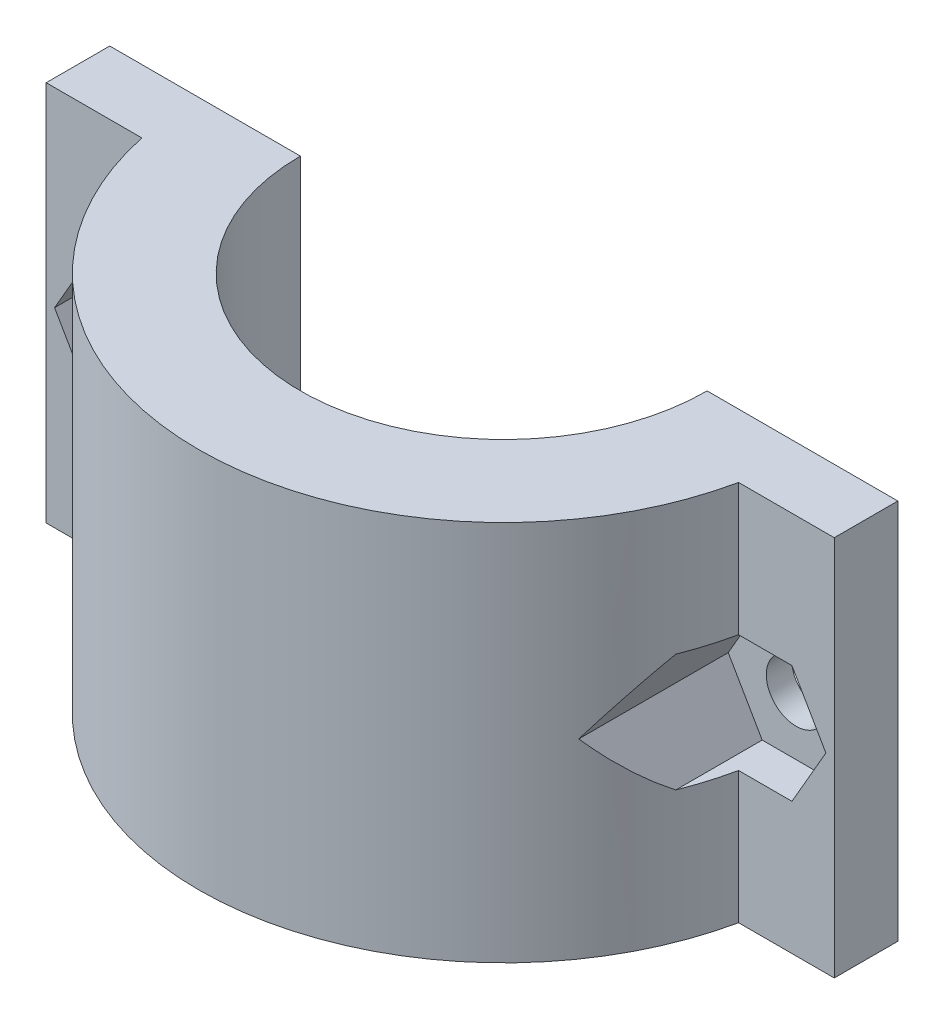
ISO-10303-21;
HEADER;
FILE_DESCRIPTION(('STEP AP214'),'2;1');
FILE_NAME('part.step','',(''),(''),'','','');
FILE_SCHEMA(('AUTOMOTIVE_DESIGN { 1 0 10303 214 1 1 1 1 }'));
ENDSEC;
DATA;
#1=APPLICATION_CONTEXT('core data for automotive mechanical design processes');
#2=APPLICATION_PROTOCOL_DEFINITION('international standard','automotive_design',2000,#1);
#3=PRODUCT_CONTEXT('',#1,'mechanical');
#4=PRODUCT('Part','Part','',(#3));
#5=PRODUCT_RELATED_PRODUCT_CATEGORY('part','',(#4));
#6=PRODUCT_DEFINITION_FORMATION('','',#4);
#7=PRODUCT_DEFINITION_CONTEXT('part definition',#1,'design');
#8=PRODUCT_DEFINITION('design','',#6,#7);
#9=PRODUCT_DEFINITION_SHAPE('','',#8);
#10=(LENGTH_UNIT() NAMED_UNIT(*) SI_UNIT(.MILLI.,.METRE.));
#11=(NAMED_UNIT(*) PLANE_ANGLE_UNIT() SI_UNIT($,.RADIAN.));
#12=(NAMED_UNIT(*) SI_UNIT($,.STERADIAN.) SOLID_ANGLE_UNIT());
#13=UNCERTAINTY_MEASURE_WITH_UNIT(LENGTH_MEASURE(1.E-05),#10,'distance_accuracy_value','');
#14=(GEOMETRIC_REPRESENTATION_CONTEXT(3) GLOBAL_UNCERTAINTY_ASSIGNED_CONTEXT((#13)) GLOBAL_UNIT_ASSIGNED_CONTEXT((#10,
#11,#12)) REPRESENTATION_CONTEXT('',''));
#15=CARTESIAN_POINT('',(0.,0.,0.));
#16=DIRECTION('',(0.,0.,1.));
#17=DIRECTION('',(1.,0.,0.));
#18=AXIS2_PLACEMENT_3D('',#15,#16,#17);
#19=CARTESIAN_POINT('',(-9.,15.,0.));
#20=DIRECTION('',(0.,0.,1.));
#21=DIRECTION('',(1.,0.,0.));
#22=AXIS2_PLACEMENT_3D('',#19,#20,#21);
#23=CYLINDRICAL_SURFACE('',#22,2.34999999999999);
#24=CARTESIAN_POINT('',(-9.,15.,0.));
#25=DIRECTION('',(0.,0.,1.));
#26=DIRECTION('',(1.,0.,0.));
#27=AXIS2_PLACEMENT_3D('',#24,#25,#26);
#28=CIRCLE('',#27,2.34999999999999);
#29=CARTESIAN_POINT('',(-6.65,15.,0.));
#30=VERTEX_POINT('',#29);
#31=EDGE_CURVE('E368',#30,#30,#28,.T.);
#32=ORIENTED_EDGE('',*,*,#31,.F.);
#33=EDGE_LOOP('',(#32));
#34=FACE_BOUND('',#33,.T.);
#35=CARTESIAN_POINT('',(-9.,15.,2.));
#36=DIRECTION('',(0.,0.,1.));
#37=DIRECTION('',(1.,0.,0.));
#38=AXIS2_PLACEMENT_3D('',#35,#36,#37);
#39=CIRCLE('',#38,2.34999999999999);
#40=CARTESIAN_POINT('',(-6.65,15.,2.));
#41=VERTEX_POINT('',#40);
#42=EDGE_CURVE('E359',#41,#41,#39,.T.);
#43=ORIENTED_EDGE('',*,*,#42,.T.);
#44=EDGE_LOOP('',(#43));
#45=FACE_BOUND('',#44,.T.);
#46=ADVANCED_FACE('F38',(#34,#45),#23,.F.);
#47=CARTESIAN_POINT('',(16.,30.,0.));
#48=DIRECTION('',(0.,-1.,0.));
#49=DIRECTION('',(-1.,0.,0.));
#50=AXIS2_PLACEMENT_3D('',#47,#48,#49);
#51=CYLINDRICAL_SURFACE('',#50,24.);
#52=CARTESIAN_POINT('',(16.,10.375,0.));
#53=DIRECTION('',(0.,1.,0.));
#54=DIRECTION('',(1.,0.,0.));
#55=AXIS2_PLACEMENT_3D('',#52,#53,#54);
#56=CIRCLE('',#55,24.);
#57=CARTESIAN_POINT('',(-7.47338918861101,10.375,5.));
#58=VERTEX_POINT('',#57);
#59=CARTESIAN_POINT('',(-6.32975500499797,10.375,8.79670628228362));
#60=VERTEX_POINT('',#59);
#61=EDGE_CURVE('E11',#58,#60,#56,.T.);
#62=ORIENTED_EDGE('',*,*,#61,.F.);
#63=DIRECTION('',(0.,-1.,0.));
#64=VECTOR('',#63,1.);
#65=CARTESIAN_POINT('',(-7.473389188611,30.,4.99999999999999));
#66=LINE('',#65,#64);
#67=CARTESIAN_POINT('',(-7.473389188611,0.,4.99999999999999));
#68=VERTEX_POINT('',#67);
#69=EDGE_CURVE('E177',#58,#68,#66,.T.);
#70=ORIENTED_EDGE('',*,*,#69,.T.);
#71=CARTESIAN_POINT('',(16.,0.,0.));
#72=DIRECTION('',(0.,1.,0.));
#73=DIRECTION('',(1.,0.,0.));
#74=AXIS2_PLACEMENT_3D('',#71,#72,#73);
#75=CIRCLE('',#74,24.);
#76=CARTESIAN_POINT('',(39.473389188611,0.,5.));
#77=VERTEX_POINT('',#76);
#78=EDGE_CURVE('E159',#68,#77,#75,.T.);
#79=ORIENTED_EDGE('',*,*,#78,.T.);
#80=DIRECTION('',(0.,-1.,0.));
#81=VECTOR('',#80,1.);
#82=CARTESIAN_POINT('',(39.473389188611,30.,5.));
#83=LINE('',#82,#81);
#84=CARTESIAN_POINT('',(39.473389188611,10.375,5.));
#85=VERTEX_POINT('',#84);
#86=EDGE_CURVE('E133',#85,#77,#83,.T.);
#87=ORIENTED_EDGE('',*,*,#86,.F.);
#88=CARTESIAN_POINT('',(16.,10.375,0.));
#89=DIRECTION('',(0.,-1.,0.));
#90=DIRECTION('',(-1.,0.,0.));
#91=AXIS2_PLACEMENT_3D('',#88,#89,#90);
#92=CIRCLE('',#91,24.);
#93=CARTESIAN_POINT('',(38.329755004998,10.375,8.79670628228361));
#94=VERTEX_POINT('',#93);
#95=EDGE_CURVE('E299',#85,#94,#92,.T.);
#96=ORIENTED_EDGE('',*,*,#95,.T.);
#97=CARTESIAN_POINT('',(16.,49.0512701892219,0.));
#98=DIRECTION('',(-0.866025403784438,-0.5,0.));
#99=DIRECTION('',(0.5,-0.866025403784439,0.));
#100=AXIS2_PLACEMENT_3D('',#97,#98,#99);
#101=ELLIPSE('',#100,48.,24.);
#102=CARTESIAN_POINT('',(35.659510009996,15.,13.7660330584693));
#103=VERTEX_POINT('',#102);
#104=EDGE_CURVE('E193',#94,#103,#101,.T.);
#105=ORIENTED_EDGE('',*,*,#104,.T.);
#106=CARTESIAN_POINT('',(16.,-19.051270189222,0.));
#107=DIRECTION('',(-0.866025403784439,0.5,0.));
#108=DIRECTION('',(-0.5,-0.866025403784439,0.));
#109=AXIS2_PLACEMENT_3D('',#106,#107,#108);
#110=ELLIPSE('',#109,48.,24.);
#111=CARTESIAN_POINT('',(38.329755004998,19.625,8.79670628228359));
#112=VERTEX_POINT('',#111);
#113=EDGE_CURVE('E197',#103,#112,#110,.T.);
#114=ORIENTED_EDGE('',*,*,#113,.T.);
#115=CARTESIAN_POINT('',(16.,19.625,0.));
#116=DIRECTION('',(0.,1.,0.));
#117=DIRECTION('',(1.,0.,0.));
#118=AXIS2_PLACEMENT_3D('',#115,#116,#117);
#119=CIRCLE('',#118,24.);
#120=CARTESIAN_POINT('',(39.473389188611,19.625,5.));
#121=VERTEX_POINT('',#120);
#122=EDGE_CURVE('E149',#112,#121,#119,.T.);
#123=ORIENTED_EDGE('',*,*,#122,.T.);
#124=CARTESIAN_POINT('',(39.473389188611,30.,5.));
#125=VERTEX_POINT('',#124);
#126=EDGE_CURVE('E174',#125,#121,#83,.T.);
#127=ORIENTED_EDGE('',*,*,#126,.F.);
#128=CARTESIAN_POINT('',(16.,30.,0.));
#129=DIRECTION('',(0.,1.,0.));
#130=DIRECTION('',(1.,0.,0.));
#131=AXIS2_PLACEMENT_3D('',#128,#129,#130);
#132=CIRCLE('',#131,24.);
#133=CARTESIAN_POINT('',(-7.473389188611,30.,4.99999999999999));
#134=VERTEX_POINT('',#133);
#135=EDGE_CURVE('E122',#134,#125,#132,.T.);
#136=ORIENTED_EDGE('',*,*,#135,.F.);
#137=CARTESIAN_POINT('',(-7.473389188611,19.625,5.));
#138=VERTEX_POINT('',#137);
#139=EDGE_CURVE('E178',#134,#138,#66,.T.);
#140=ORIENTED_EDGE('',*,*,#139,.T.);
#141=CARTESIAN_POINT('',(16.,19.625,0.));
#142=DIRECTION('',(0.,-1.,0.));
#143=DIRECTION('',(-1.,0.,0.));
#144=AXIS2_PLACEMENT_3D('',#141,#142,#143);
#145=CIRCLE('',#144,24.);
#146=CARTESIAN_POINT('',(-6.32975500499798,19.625,8.7967062822836));
#147=VERTEX_POINT('',#146);
#148=EDGE_CURVE('E201',#147,#138,#145,.T.);
#149=ORIENTED_EDGE('',*,*,#148,.F.);
#150=CARTESIAN_POINT('',(16.,-19.051270189222,0.));
#151=DIRECTION('',(-0.866025403784439,-0.5,0.));
#152=DIRECTION('',(0.5,-0.866025403784439,0.));
#153=AXIS2_PLACEMENT_3D('',#150,#151,#152);
#154=ELLIPSE('',#153,48.,24.);
#155=CARTESIAN_POINT('',(-3.65951000999596,15.,13.7660330584693));
#156=VERTEX_POINT('',#155);
#157=EDGE_CURVE('E205',#156,#147,#154,.T.);
#158=ORIENTED_EDGE('',*,*,#157,.F.);
#159=CARTESIAN_POINT('',(16.,49.0512701892219,0.));
#160=DIRECTION('',(-0.866025403784438,0.5,0.));
#161=DIRECTION('',(-0.5,-0.866025403784439,0.));
#162=AXIS2_PLACEMENT_3D('',#159,#160,#161);
#163=ELLIPSE('',#162,48.,24.);
#164=EDGE_CURVE('E48',#60,#156,#163,.T.);
#165=ORIENTED_EDGE('',*,*,#164,.F.);
#166=EDGE_LOOP('',(#62,#70,#79,#87,#96,#105,#114,#123,#127,#136,#140,#149,#158,#165));
#167=FACE_BOUND('',#166,.T.);
#168=ADVANCED_FACE('F238',(#167),#51,.T.);
#169=CARTESIAN_POINT('',(16.,30.,0.));
#170=DIRECTION('',(0.,-1.,0.));
#171=DIRECTION('',(-1.,0.,0.));
#172=AXIS2_PLACEMENT_3D('',#169,#170,#171);
#173=CYLINDRICAL_SURFACE('',#172,16.);
#174=CARTESIAN_POINT('',(16.,0.,0.));
#175=DIRECTION('',(0.,-1.,0.));
#176=DIRECTION('',(1.,0.,0.));
#177=AXIS2_PLACEMENT_3D('',#174,#175,#176);
#178=CIRCLE('',#177,16.);
#179=CARTESIAN_POINT('',(32.,0.,0.));
#180=VERTEX_POINT('',#179);
#181=CARTESIAN_POINT('',(0.,0.,0.));
#182=VERTEX_POINT('',#181);
#183=EDGE_CURVE('E144',#180,#182,#178,.T.);
#184=ORIENTED_EDGE('',*,*,#183,.T.);
#185=DIRECTION('',(0.,-1.,0.));
#186=VECTOR('',#185,1.);
#187=CARTESIAN_POINT('',(0.,30.,0.));
#188=LINE('',#187,#186);
#189=CARTESIAN_POINT('',(0.,30.,0.));
#190=VERTEX_POINT('',#189);
#191=EDGE_CURVE('E190',#190,#182,#188,.T.);
#192=ORIENTED_EDGE('',*,*,#191,.F.);
#193=CARTESIAN_POINT('',(16.,30.,0.));
#194=DIRECTION('',(0.,-1.,0.));
#195=DIRECTION('',(1.,0.,0.));
#196=AXIS2_PLACEMENT_3D('',#193,#194,#195);
#197=CIRCLE('',#196,16.);
#198=CARTESIAN_POINT('',(32.,30.,0.));
#199=VERTEX_POINT('',#198);
#200=EDGE_CURVE('E169',#199,#190,#197,.T.);
#201=ORIENTED_EDGE('',*,*,#200,.F.);
#202=DIRECTION('',(0.,-1.,0.));
#203=VECTOR('',#202,1.);
#204=CARTESIAN_POINT('',(32.,30.,0.));
#205=LINE('',#204,#203);
#206=EDGE_CURVE('E140',#199,#180,#205,.T.);
#207=ORIENTED_EDGE('',*,*,#206,.T.);
#208=EDGE_LOOP('',(#184,#192,#201,#207));
#209=FACE_BOUND('',#208,.T.);
#210=ADVANCED_FACE('F40',(#209),#173,.F.);
#211=CARTESIAN_POINT('',(0.,30.,0.));
#212=DIRECTION('',(0.,0.,1.));
#213=DIRECTION('',(1.,0.,0.));
#214=AXIS2_PLACEMENT_3D('',#211,#212,#213);
#215=PLANE('',#214);
#216=ORIENTED_EDGE('',*,*,#31,.T.);
#217=EDGE_LOOP('',(#216));
#218=FACE_BOUND('',#217,.T.);
#219=DIRECTION('',(-1.,0.,0.));
#220=VECTOR('',#219,1.);
#221=CARTESIAN_POINT('',(0.,0.,0.));
#222=LINE('',#221,#220);
#223=CARTESIAN_POINT('',(-15.,0.,0.));
#224=VERTEX_POINT('',#223);
#225=EDGE_CURVE('E148',#182,#224,#222,.T.);
#226=ORIENTED_EDGE('',*,*,#225,.T.);
#227=DIRECTION('',(0.,-1.,0.));
#228=VECTOR('',#227,1.);
#229=CARTESIAN_POINT('',(-15.,30.,0.));
#230=LINE('',#229,#228);
#231=CARTESIAN_POINT('',(-15.,30.,0.));
#232=VERTEX_POINT('',#231);
#233=EDGE_CURVE('E186',#232,#224,#230,.T.);
#234=ORIENTED_EDGE('',*,*,#233,.F.);
#235=DIRECTION('',(-1.,0.,0.));
#236=VECTOR('',#235,1.);
#237=CARTESIAN_POINT('',(0.,30.,0.));
#238=LINE('',#237,#236);
#239=EDGE_CURVE('E101',#190,#232,#238,.T.);
#240=ORIENTED_EDGE('',*,*,#239,.F.);
#241=ORIENTED_EDGE('',*,*,#191,.T.);
#242=EDGE_LOOP('',(#226,#234,#240,#241));
#243=FACE_BOUND('',#242,.T.);
#244=ADVANCED_FACE('F483',(#218,#243),#215,.F.);
#245=CARTESIAN_POINT('',(-15.,30.,0.));
#246=DIRECTION('',(1.,0.,0.));
#247=DIRECTION('',(0.,0.,-1.));
#248=AXIS2_PLACEMENT_3D('',#245,#246,#247);
#249=PLANE('',#248);
#250=DIRECTION('',(0.,0.,1.));
#251=VECTOR('',#250,1.);
#252=CARTESIAN_POINT('',(-15.,0.,0.));
#253=LINE('',#252,#251);
#254=CARTESIAN_POINT('',(-15.,0.,5.));
#255=VERTEX_POINT('',#254);
#256=EDGE_CURVE('E152',#224,#255,#253,.T.);
#257=ORIENTED_EDGE('',*,*,#256,.T.);
#258=DIRECTION('',(0.,-1.,0.));
#259=VECTOR('',#258,1.);
#260=CARTESIAN_POINT('',(-15.,30.,5.));
#261=LINE('',#260,#259);
#262=CARTESIAN_POINT('',(-15.,30.,5.));
#263=VERTEX_POINT('',#262);
#264=EDGE_CURVE('E182',#263,#255,#261,.T.);
#265=ORIENTED_EDGE('',*,*,#264,.F.);
#266=DIRECTION('',(0.,0.,1.));
#267=VECTOR('',#266,1.);
#268=CARTESIAN_POINT('',(-15.,30.,0.));
#269=LINE('',#268,#267);
#270=EDGE_CURVE('E314',#232,#263,#269,.T.);
#271=ORIENTED_EDGE('',*,*,#270,.F.);
#272=ORIENTED_EDGE('',*,*,#233,.T.);
#273=EDGE_LOOP('',(#257,#265,#271,#272));
#274=FACE_BOUND('',#273,.T.);
#275=ADVANCED_FACE('F481',(#274),#249,.F.);
#276=CARTESIAN_POINT('',(-7.473389188611,30.,5.));
#277=DIRECTION('',(0.,0.,-1.));
#278=DIRECTION('',(-1.,0.,0.));
#279=AXIS2_PLACEMENT_3D('',#276,#277,#278);
#280=PLANE('',#279);
#281=ORIENTED_EDGE('',*,*,#69,.F.);
#282=DIRECTION('',(1.,0.,0.));
#283=VECTOR('',#282,1.);
#284=CARTESIAN_POINT('',(-11.670244995002,10.375,5.));
#285=LINE('',#284,#283);
#286=CARTESIAN_POINT('',(-11.670244995002,10.375,5.));
#287=VERTEX_POINT('',#286);
#288=EDGE_CURVE('E499',#287,#58,#285,.T.);
#289=ORIENTED_EDGE('',*,*,#288,.F.);
#290=DIRECTION('',(0.5,-0.866025403784439,0.));
#291=VECTOR('',#290,1.);
#292=CARTESIAN_POINT('',(-14.340489990004,15.,5.));
#293=LINE('',#292,#291);
#294=CARTESIAN_POINT('',(-14.340489990004,15.,5.));
#295=VERTEX_POINT('',#294);
#296=EDGE_CURVE('E523',#295,#287,#293,.T.);
#297=ORIENTED_EDGE('',*,*,#296,.F.);
#298=DIRECTION('',(-0.5,-0.866025403784438,0.));
#299=VECTOR('',#298,1.);
#300=CARTESIAN_POINT('',(-11.670244995002,19.625,5.));
#301=LINE('',#300,#299);
#302=CARTESIAN_POINT('',(-11.670244995002,19.625,5.));
#303=VERTEX_POINT('',#302);
#304=EDGE_CURVE('E512',#303,#295,#301,.T.);
#305=ORIENTED_EDGE('',*,*,#304,.F.);
#306=DIRECTION('',(-1.,0.,0.));
#307=VECTOR('',#306,1.);
#308=CARTESIAN_POINT('',(-6.32975500499798,19.625,5.));
#309=LINE('',#308,#307);
#310=EDGE_CURVE('E249',#138,#303,#309,.T.);
#311=ORIENTED_EDGE('',*,*,#310,.F.);
#312=ORIENTED_EDGE('',*,*,#139,.F.);
#313=DIRECTION('',(1.,0.,0.));
#314=VECTOR('',#313,1.);
#315=CARTESIAN_POINT('',(-7.473389188611,30.,5.));
#316=LINE('',#315,#314);
#317=EDGE_CURVE('E317',#263,#134,#316,.T.);
#318=ORIENTED_EDGE('',*,*,#317,.F.);
#319=ORIENTED_EDGE('',*,*,#264,.T.);
#320=DIRECTION('',(1.,0.,0.));
#321=VECTOR('',#320,1.);
#322=CARTESIAN_POINT('',(-7.473389188611,0.,5.));
#323=LINE('',#322,#321);
#324=EDGE_CURVE('E155',#255,#68,#323,.T.);
#325=ORIENTED_EDGE('',*,*,#324,.T.);
#326=EDGE_LOOP('',(#281,#289,#297,#305,#311,#312,#318,#319,#325));
#327=FACE_BOUND('',#326,.T.);
#328=ADVANCED_FACE('F324',(#327),#280,.F.);
#329=CARTESIAN_POINT('',(39.473389188611,30.,5.));
#330=DIRECTION('',(0.,0.,-1.));
#331=DIRECTION('',(-1.,0.,0.));
#332=AXIS2_PLACEMENT_3D('',#329,#330,#331);
#333=PLANE('',#332);
#334=ORIENTED_EDGE('',*,*,#126,.T.);
#335=DIRECTION('',(-1.,0.,0.));
#336=VECTOR('',#335,1.);
#337=CARTESIAN_POINT('',(38.329755004998,19.625,5.));
#338=LINE('',#337,#336);
#339=CARTESIAN_POINT('',(43.670244995002,19.625,5.));
#340=VERTEX_POINT('',#339);
#341=EDGE_CURVE('E328',#340,#121,#338,.T.);
#342=ORIENTED_EDGE('',*,*,#341,.F.);
#343=DIRECTION('',(-0.5,0.866025403784438,0.));
#344=VECTOR('',#343,1.);
#345=CARTESIAN_POINT('',(43.670244995002,19.625,5.));
#346=LINE('',#345,#344);
#347=CARTESIAN_POINT('',(46.340489990004,15.,5.));
#348=VERTEX_POINT('',#347);
#349=EDGE_CURVE('E332',#348,#340,#346,.T.);
#350=ORIENTED_EDGE('',*,*,#349,.F.);
#351=DIRECTION('',(0.5,0.866025403784439,0.));
#352=VECTOR('',#351,1.);
#353=CARTESIAN_POINT('',(46.340489990004,15.,5.));
#354=LINE('',#353,#352);
#355=CARTESIAN_POINT('',(43.670244995002,10.375,5.));
#356=VERTEX_POINT('',#355);
#357=EDGE_CURVE('E342',#356,#348,#354,.T.);
#358=ORIENTED_EDGE('',*,*,#357,.F.);
#359=DIRECTION('',(1.,0.,0.));
#360=VECTOR('',#359,1.);
#361=CARTESIAN_POINT('',(43.670244995002,10.375,5.));
#362=LINE('',#361,#360);
#363=EDGE_CURVE('E337',#85,#356,#362,.T.);
#364=ORIENTED_EDGE('',*,*,#363,.F.);
#365=ORIENTED_EDGE('',*,*,#86,.T.);
#366=DIRECTION('',(1.,0.,0.));
#367=VECTOR('',#366,1.);
#368=CARTESIAN_POINT('',(39.473389188611,0.,5.));
#369=LINE('',#368,#367);
#370=CARTESIAN_POINT('',(47.,0.,5.));
#371=VERTEX_POINT('',#370);
#372=EDGE_CURVE('E131',#77,#371,#369,.T.);
#373=ORIENTED_EDGE('',*,*,#372,.T.);
#374=DIRECTION('',(0.,-1.,0.));
#375=VECTOR('',#374,1.);
#376=CARTESIAN_POINT('',(47.,30.,5.));
#377=LINE('',#376,#375);
#378=CARTESIAN_POINT('',(47.,30.,5.));
#379=VERTEX_POINT('',#378);
#380=EDGE_CURVE('E128',#379,#371,#377,.T.);
#381=ORIENTED_EDGE('',*,*,#380,.F.);
#382=DIRECTION('',(1.,0.,0.));
#383=VECTOR('',#382,1.);
#384=CARTESIAN_POINT('',(39.473389188611,30.,5.));
#385=LINE('',#384,#383);
#386=EDGE_CURVE('E116',#125,#379,#385,.T.);
#387=ORIENTED_EDGE('',*,*,#386,.F.);
#388=EDGE_LOOP('',(#334,#342,#350,#358,#364,#365,#373,#381,#387));
#389=FACE_BOUND('',#388,.T.);
#390=ADVANCED_FACE('F129',(#389),#333,.F.);
#391=CARTESIAN_POINT('',(47.,30.,5.));
#392=DIRECTION('',(-1.,0.,0.));
#393=DIRECTION('',(0.,0.,1.));
#394=AXIS2_PLACEMENT_3D('',#391,#392,#393);
#395=PLANE('',#394);
#396=DIRECTION('',(0.,0.,-1.));
#397=VECTOR('',#396,1.);
#398=CARTESIAN_POINT('',(47.,0.,5.));
#399=LINE('',#398,#397);
#400=CARTESIAN_POINT('',(47.,0.,0.));
#401=VERTEX_POINT('',#400);
#402=EDGE_CURVE('E86',#371,#401,#399,.T.);
#403=ORIENTED_EDGE('',*,*,#402,.T.);
#404=DIRECTION('',(0.,-1.,0.));
#405=VECTOR('',#404,1.);
#406=CARTESIAN_POINT('',(47.,30.,0.));
#407=LINE('',#406,#405);
#408=CARTESIAN_POINT('',(47.,30.,0.));
#409=VERTEX_POINT('',#408);
#410=EDGE_CURVE('E134',#409,#401,#407,.T.);
#411=ORIENTED_EDGE('',*,*,#410,.F.);
#412=DIRECTION('',(0.,0.,-1.));
#413=VECTOR('',#412,1.);
#414=CARTESIAN_POINT('',(47.,30.,5.));
#415=LINE('',#414,#413);
#416=EDGE_CURVE('E120',#379,#409,#415,.T.);
#417=ORIENTED_EDGE('',*,*,#416,.F.);
#418=ORIENTED_EDGE('',*,*,#380,.T.);
#419=EDGE_LOOP('',(#403,#411,#417,#418));
#420=FACE_BOUND('',#419,.T.);
#421=ADVANCED_FACE('F136',(#420),#395,.F.);
#422=CARTESIAN_POINT('',(32.,30.,0.));
#423=DIRECTION('',(0.,0.,1.));
#424=DIRECTION('',(1.,0.,0.));
#425=AXIS2_PLACEMENT_3D('',#422,#423,#424);
#426=PLANE('',#425);
#427=CARTESIAN_POINT('',(41.,15.,0.));
#428=DIRECTION('',(0.,0.,1.));
#429=DIRECTION('',(1.,0.,0.));
#430=AXIS2_PLACEMENT_3D('',#427,#428,#429);
#431=CIRCLE('',#430,2.34999999999999);
#432=CARTESIAN_POINT('',(43.35,15.,0.));
#433=VERTEX_POINT('',#432);
#434=EDGE_CURVE('E372',#433,#433,#431,.F.);
#435=ORIENTED_EDGE('',*,*,#434,.F.);
#436=EDGE_LOOP('',(#435));
#437=FACE_BOUND('',#436,.T.);
#438=DIRECTION('',(-1.,0.,0.));
#439=VECTOR('',#438,1.);
#440=CARTESIAN_POINT('',(32.,0.,0.));
#441=LINE('',#440,#439);
#442=EDGE_CURVE('E92',#401,#180,#441,.T.);
#443=ORIENTED_EDGE('',*,*,#442,.T.);
#444=ORIENTED_EDGE('',*,*,#206,.F.);
#445=DIRECTION('',(-1.,0.,0.));
#446=VECTOR('',#445,1.);
#447=CARTESIAN_POINT('',(32.,30.,0.));
#448=LINE('',#447,#446);
#449=EDGE_CURVE('E56',#409,#199,#448,.T.);
#450=ORIENTED_EDGE('',*,*,#449,.F.);
#451=ORIENTED_EDGE('',*,*,#410,.T.);
#452=EDGE_LOOP('',(#443,#444,#450,#451));
#453=FACE_BOUND('',#452,.T.);
#454=ADVANCED_FACE('F468',(#437,#453),#426,.F.);
#455=CARTESIAN_POINT('',(16.,30.,0.));
#456=DIRECTION('',(0.,1.,0.));
#457=DIRECTION('',(1.,0.,0.));
#458=AXIS2_PLACEMENT_3D('',#455,#456,#457);
#459=PLANE('',#458);
#460=ORIENTED_EDGE('',*,*,#200,.T.);
#461=ORIENTED_EDGE('',*,*,#239,.T.);
#462=ORIENTED_EDGE('',*,*,#270,.T.);
#463=ORIENTED_EDGE('',*,*,#317,.T.);
#464=ORIENTED_EDGE('',*,*,#135,.T.);
#465=ORIENTED_EDGE('',*,*,#386,.T.);
#466=ORIENTED_EDGE('',*,*,#416,.T.);
#467=ORIENTED_EDGE('',*,*,#449,.T.);
#468=EDGE_LOOP('',(#460,#461,#462,#463,#464,#465,#466,#467));
#469=FACE_BOUND('',#468,.T.);
#470=ADVANCED_FACE('F118',(#469),#459,.T.);
#471=CARTESIAN_POINT('',(16.,0.,0.));
#472=DIRECTION('',(0.,1.,0.));
#473=DIRECTION('',(1.,0.,0.));
#474=AXIS2_PLACEMENT_3D('',#471,#472,#473);
#475=PLANE('',#474);
#476=ORIENTED_EDGE('',*,*,#183,.F.);
#477=ORIENTED_EDGE('',*,*,#442,.F.);
#478=ORIENTED_EDGE('',*,*,#402,.F.);
#479=ORIENTED_EDGE('',*,*,#372,.F.);
#480=ORIENTED_EDGE('',*,*,#78,.F.);
#481=ORIENTED_EDGE('',*,*,#324,.F.);
#482=ORIENTED_EDGE('',*,*,#256,.F.);
#483=ORIENTED_EDGE('',*,*,#225,.F.);
#484=EDGE_LOOP('',(#476,#477,#478,#479,#480,#481,#482,#483));
#485=FACE_BOUND('',#484,.T.);
#486=ADVANCED_FACE('F465',(#485),#475,.F.);
#487=CARTESIAN_POINT('',(35.659510009996,15.,55.));
#488=DIRECTION('',(-0.866025403784439,0.5,0.));
#489=DIRECTION('',(0.5,0.866025403784439,0.));
#490=AXIS2_PLACEMENT_3D('',#487,#488,#489);
#491=PLANE('',#490);
#492=DIRECTION('',(0.,0.,-1.));
#493=VECTOR('',#492,1.);
#494=CARTESIAN_POINT('',(35.659510009996,15.,55.));
#495=LINE('',#494,#493);
#496=CARTESIAN_POINT('',(35.659510009996,15.,2.));
#497=VERTEX_POINT('',#496);
#498=EDGE_CURVE('E281',#103,#497,#495,.T.);
#499=ORIENTED_EDGE('',*,*,#498,.T.);
#500=DIRECTION('',(-0.5,-0.866025403784439,0.));
#501=VECTOR('',#500,1.);
#502=CARTESIAN_POINT('',(35.659510009996,15.,2.));
#503=LINE('',#502,#501);
#504=CARTESIAN_POINT('',(38.329755004998,19.625,2.));
#505=VERTEX_POINT('',#504);
#506=EDGE_CURVE('E396',#505,#497,#503,.T.);
#507=ORIENTED_EDGE('',*,*,#506,.F.);
#508=DIRECTION('',(0.,0.,-1.));
#509=VECTOR('',#508,1.);
#510=CARTESIAN_POINT('',(38.329755004998,19.625,55.));
#511=LINE('',#510,#509);
#512=EDGE_CURVE('E284',#112,#505,#511,.T.);
#513=ORIENTED_EDGE('',*,*,#512,.F.);
#514=ORIENTED_EDGE('',*,*,#113,.F.);
#515=EDGE_LOOP('',(#499,#507,#513,#514));
#516=FACE_BOUND('',#515,.T.);
#517=ADVANCED_FACE('F278',(#516),#491,.F.);
#518=CARTESIAN_POINT('',(38.329755004998,10.375,55.));
#519=DIRECTION('',(-0.866025403784438,-0.5,0.));
#520=DIRECTION('',(-0.5,0.866025403784439,0.));
#521=AXIS2_PLACEMENT_3D('',#518,#519,#520);
#522=PLANE('',#521);
#523=DIRECTION('',(0.,0.,-1.));
#524=VECTOR('',#523,1.);
#525=CARTESIAN_POINT('',(38.329755004998,10.375,55.));
#526=LINE('',#525,#524);
#527=CARTESIAN_POINT('',(38.329755004998,10.375,2.));
#528=VERTEX_POINT('',#527);
#529=EDGE_CURVE('E294',#94,#528,#526,.T.);
#530=ORIENTED_EDGE('',*,*,#529,.T.);
#531=DIRECTION('',(0.5,-0.866025403784438,0.));
#532=VECTOR('',#531,1.);
#533=CARTESIAN_POINT('',(38.329755004998,10.375,2.));
#534=LINE('',#533,#532);
#535=EDGE_CURVE('E291',#497,#528,#534,.T.);
#536=ORIENTED_EDGE('',*,*,#535,.F.);
#537=ORIENTED_EDGE('',*,*,#498,.F.);
#538=ORIENTED_EDGE('',*,*,#104,.F.);
#539=EDGE_LOOP('',(#530,#536,#537,#538));
#540=FACE_BOUND('',#539,.T.);
#541=ADVANCED_FACE('F288',(#540),#522,.F.);
#542=CARTESIAN_POINT('',(38.329755004998,19.625,55.));
#543=DIRECTION('',(0.,1.,0.));
#544=DIRECTION('',(1.,0.,0.));
#545=AXIS2_PLACEMENT_3D('',#542,#543,#544);
#546=PLANE('',#545);
#547=ORIENTED_EDGE('',*,*,#512,.T.);
#548=DIRECTION('',(-1.,0.,0.));
#549=VECTOR('',#548,1.);
#550=CARTESIAN_POINT('',(38.329755004998,19.625,2.));
#551=LINE('',#550,#549);
#552=CARTESIAN_POINT('',(43.670244995002,19.625,2.));
#553=VERTEX_POINT('',#552);
#554=EDGE_CURVE('E355',#553,#505,#551,.T.);
#555=ORIENTED_EDGE('',*,*,#554,.F.);
#556=DIRECTION('',(0.,0.,1.));
#557=VECTOR('',#556,1.);
#558=CARTESIAN_POINT('',(43.670244995002,19.625,2.));
#559=LINE('',#558,#557);
#560=EDGE_CURVE('E356',#553,#340,#559,.T.);
#561=ORIENTED_EDGE('',*,*,#560,.T.);
#562=ORIENTED_EDGE('',*,*,#341,.T.);
#563=ORIENTED_EDGE('',*,*,#122,.F.);
#564=EDGE_LOOP('',(#547,#555,#561,#562,#563));
#565=FACE_BOUND('',#564,.T.);
#566=ADVANCED_FACE('F456',(#565),#546,.F.);
#567=CARTESIAN_POINT('',(43.670244995002,10.375,55.));
#568=DIRECTION('',(0.,-1.,0.));
#569=DIRECTION('',(-1.,0.,0.));
#570=AXIS2_PLACEMENT_3D('',#567,#568,#569);
#571=PLANE('',#570);
#572=ORIENTED_EDGE('',*,*,#95,.F.);
#573=ORIENTED_EDGE('',*,*,#363,.T.);
#574=DIRECTION('',(0.,0.,1.));
#575=VECTOR('',#574,1.);
#576=CARTESIAN_POINT('',(43.670244995002,10.375,2.));
#577=LINE('',#576,#575);
#578=CARTESIAN_POINT('',(43.670244995002,10.375,2.));
#579=VERTEX_POINT('',#578);
#580=EDGE_CURVE('E364',#579,#356,#577,.T.);
#581=ORIENTED_EDGE('',*,*,#580,.F.);
#582=DIRECTION('',(1.,0.,0.));
#583=VECTOR('',#582,1.);
#584=CARTESIAN_POINT('',(43.670244995002,10.375,2.));
#585=LINE('',#584,#583);
#586=EDGE_CURVE('E386',#528,#579,#585,.T.);
#587=ORIENTED_EDGE('',*,*,#586,.F.);
#588=ORIENTED_EDGE('',*,*,#529,.F.);
#589=EDGE_LOOP('',(#572,#573,#581,#587,#588));
#590=FACE_BOUND('',#589,.T.);
#591=ADVANCED_FACE('F387',(#590),#571,.F.);
#592=CARTESIAN_POINT('',(-11.670244995002,10.375,55.));
#593=DIRECTION('',(0.,1.,0.));
#594=DIRECTION('',(1.,0.,0.));
#595=AXIS2_PLACEMENT_3D('',#592,#593,#594);
#596=PLANE('',#595);
#597=ORIENTED_EDGE('',*,*,#61,.T.);
#598=DIRECTION('',(0.,0.,-1.));
#599=VECTOR('',#598,1.);
#600=CARTESIAN_POINT('',(-6.32975500499797,10.375,55.));
#601=LINE('',#600,#599);
#602=CARTESIAN_POINT('',(-6.32975500499797,10.375,2.));
#603=VERTEX_POINT('',#602);
#604=EDGE_CURVE('E222',#60,#603,#601,.T.);
#605=ORIENTED_EDGE('',*,*,#604,.T.);
#606=DIRECTION('',(1.,0.,0.));
#607=VECTOR('',#606,1.);
#608=CARTESIAN_POINT('',(-11.670244995002,10.375,2.));
#609=LINE('',#608,#607);
#610=CARTESIAN_POINT('',(-11.670244995002,10.375,2.));
#611=VERTEX_POINT('',#610);
#612=EDGE_CURVE('E526',#611,#603,#609,.T.);
#613=ORIENTED_EDGE('',*,*,#612,.F.);
#614=DIRECTION('',(0.,0.,1.));
#615=VECTOR('',#614,1.);
#616=CARTESIAN_POINT('',(-11.670244995002,10.375,2.));
#617=LINE('',#616,#615);
#618=EDGE_CURVE('E376',#611,#287,#617,.T.);
#619=ORIENTED_EDGE('',*,*,#618,.T.);
#620=ORIENTED_EDGE('',*,*,#288,.T.);
#621=EDGE_LOOP('',(#597,#605,#613,#619,#620));
#622=FACE_BOUND('',#621,.T.);
#623=ADVANCED_FACE('F452',(#622),#596,.T.);
#624=CARTESIAN_POINT('',(-6.32975500499797,10.375,55.));
#625=DIRECTION('',(-0.866025403784438,0.5,0.));
#626=DIRECTION('',(0.5,0.866025403784439,0.));
#627=AXIS2_PLACEMENT_3D('',#624,#625,#626);
#628=PLANE('',#627);
#629=ORIENTED_EDGE('',*,*,#164,.T.);
#630=DIRECTION('',(0.,0.,-1.));
#631=VECTOR('',#630,1.);
#632=CARTESIAN_POINT('',(-3.65951000999596,15.,55.));
#633=LINE('',#632,#631);
#634=CARTESIAN_POINT('',(-3.65951000999596,15.,2.));
#635=VERTEX_POINT('',#634);
#636=EDGE_CURVE('E219',#156,#635,#633,.T.);
#637=ORIENTED_EDGE('',*,*,#636,.T.);
#638=DIRECTION('',(0.5,0.866025403784438,0.));
#639=VECTOR('',#638,1.);
#640=CARTESIAN_POINT('',(-6.32975500499797,10.375,2.));
#641=LINE('',#640,#639);
#642=EDGE_CURVE('E554',#603,#635,#641,.T.);
#643=ORIENTED_EDGE('',*,*,#642,.F.);
#644=ORIENTED_EDGE('',*,*,#604,.F.);
#645=EDGE_LOOP('',(#629,#637,#643,#644));
#646=FACE_BOUND('',#645,.T.);
#647=ADVANCED_FACE('F216',(#646),#628,.T.);
#648=CARTESIAN_POINT('',(-3.65951000999596,15.,55.));
#649=DIRECTION('',(-0.866025403784439,-0.5,0.));
#650=DIRECTION('',(-0.5,0.866025403784439,0.));
#651=AXIS2_PLACEMENT_3D('',#648,#649,#650);
#652=PLANE('',#651);
#653=ORIENTED_EDGE('',*,*,#157,.T.);
#654=DIRECTION('',(0.,0.,-1.));
#655=VECTOR('',#654,1.);
#656=CARTESIAN_POINT('',(-6.32975500499798,19.625,55.));
#657=LINE('',#656,#655);
#658=CARTESIAN_POINT('',(-6.32975500499798,19.625,2.));
#659=VERTEX_POINT('',#658);
#660=EDGE_CURVE('E235',#147,#659,#657,.T.);
#661=ORIENTED_EDGE('',*,*,#660,.T.);
#662=DIRECTION('',(-0.5,0.866025403784439,0.));
#663=VECTOR('',#662,1.);
#664=CARTESIAN_POINT('',(-3.65951000999596,15.,2.));
#665=LINE('',#664,#663);
#666=EDGE_CURVE('E232',#635,#659,#665,.T.);
#667=ORIENTED_EDGE('',*,*,#666,.F.);
#668=ORIENTED_EDGE('',*,*,#636,.F.);
#669=EDGE_LOOP('',(#653,#661,#667,#668));
#670=FACE_BOUND('',#669,.T.);
#671=ADVANCED_FACE('F228',(#670),#652,.T.);
#672=CARTESIAN_POINT('',(-6.32975500499798,19.625,55.));
#673=DIRECTION('',(0.,-1.,0.));
#674=DIRECTION('',(-1.,0.,0.));
#675=AXIS2_PLACEMENT_3D('',#672,#673,#674);
#676=PLANE('',#675);
#677=ORIENTED_EDGE('',*,*,#148,.T.);
#678=ORIENTED_EDGE('',*,*,#310,.T.);
#679=DIRECTION('',(0.,0.,1.));
#680=VECTOR('',#679,1.);
#681=CARTESIAN_POINT('',(-11.670244995002,19.625,2.));
#682=LINE('',#681,#680);
#683=CARTESIAN_POINT('',(-11.670244995002,19.625,2.));
#684=VERTEX_POINT('',#683);
#685=EDGE_CURVE('E533',#684,#303,#682,.T.);
#686=ORIENTED_EDGE('',*,*,#685,.F.);
#687=DIRECTION('',(-1.,0.,0.));
#688=VECTOR('',#687,1.);
#689=CARTESIAN_POINT('',(-6.32975500499798,19.625,2.));
#690=LINE('',#689,#688);
#691=EDGE_CURVE('E546',#659,#684,#690,.T.);
#692=ORIENTED_EDGE('',*,*,#691,.F.);
#693=ORIENTED_EDGE('',*,*,#660,.F.);
#694=EDGE_LOOP('',(#677,#678,#686,#692,#693));
#695=FACE_BOUND('',#694,.T.);
#696=ADVANCED_FACE('F245',(#695),#676,.T.);
#697=CARTESIAN_POINT('',(41.,15.,0.));
#698=DIRECTION('',(0.,0.,1.));
#699=DIRECTION('',(1.,0.,0.));
#700=AXIS2_PLACEMENT_3D('',#697,#698,#699);
#701=CYLINDRICAL_SURFACE('',#700,2.34999999999999);
#702=CARTESIAN_POINT('',(41.,15.,2.));
#703=DIRECTION('',(0.,0.,1.));
#704=DIRECTION('',(-1.,0.,0.));
#705=AXIS2_PLACEMENT_3D('',#702,#703,#704);
#706=CIRCLE('',#705,2.34999999999999);
#707=CARTESIAN_POINT('',(38.65,15.,2.));
#708=VERTEX_POINT('',#707);
#709=EDGE_CURVE('E338',#708,#708,#706,.T.);
#710=ORIENTED_EDGE('',*,*,#709,.T.);
#711=EDGE_LOOP('',(#710));
#712=FACE_BOUND('',#711,.T.);
#713=ORIENTED_EDGE('',*,*,#434,.T.);
#714=EDGE_LOOP('',(#713));
#715=FACE_BOUND('',#714,.T.);
#716=ADVANCED_FACE('F441',(#712,#715),#701,.F.);
#717=CARTESIAN_POINT('',(-14.340489990004,15.,2.));
#718=DIRECTION('',(-0.866025403784439,-0.5,0.));
#719=DIRECTION('',(-0.5,0.866025403784439,0.));
#720=AXIS2_PLACEMENT_3D('',#717,#718,#719);
#721=PLANE('',#720);
#722=ORIENTED_EDGE('',*,*,#296,.T.);
#723=ORIENTED_EDGE('',*,*,#618,.F.);
#724=DIRECTION('',(0.5,-0.866025403784439,0.));
#725=VECTOR('',#724,1.);
#726=CARTESIAN_POINT('',(-14.340489990004,15.,2.));
#727=LINE('',#726,#725);
#728=CARTESIAN_POINT('',(-14.340489990004,15.,2.));
#729=VERTEX_POINT('',#728);
#730=EDGE_CURVE('E517',#729,#611,#727,.T.);
#731=ORIENTED_EDGE('',*,*,#730,.F.);
#732=DIRECTION('',(0.,0.,1.));
#733=VECTOR('',#732,1.);
#734=CARTESIAN_POINT('',(-14.340489990004,15.,2.));
#735=LINE('',#734,#733);
#736=EDGE_CURVE('E529',#729,#295,#735,.T.);
#737=ORIENTED_EDGE('',*,*,#736,.T.);
#738=EDGE_LOOP('',(#722,#723,#731,#737));
#739=FACE_BOUND('',#738,.T.);
#740=ADVANCED_FACE('F444',(#739),#721,.F.);
#741=CARTESIAN_POINT('',(-11.670244995002,19.625,2.));
#742=DIRECTION('',(-0.866025403784438,0.500000000000001,0.));
#743=DIRECTION('',(0.500000000000001,0.866025403784438,0.));
#744=AXIS2_PLACEMENT_3D('',#741,#742,#743);
#745=PLANE('',#744);
#746=ORIENTED_EDGE('',*,*,#304,.T.);
#747=ORIENTED_EDGE('',*,*,#736,.F.);
#748=DIRECTION('',(-0.5,-0.866025403784438,0.));
#749=VECTOR('',#748,1.);
#750=CARTESIAN_POINT('',(-11.670244995002,19.625,2.));
#751=LINE('',#750,#749);
#752=EDGE_CURVE('E540',#684,#729,#751,.T.);
#753=ORIENTED_EDGE('',*,*,#752,.F.);
#754=ORIENTED_EDGE('',*,*,#685,.T.);
#755=EDGE_LOOP('',(#746,#747,#753,#754));
#756=FACE_BOUND('',#755,.T.);
#757=ADVANCED_FACE('F572',(#756),#745,.F.);
#758=CARTESIAN_POINT('',(16.,0.,2.));
#759=DIRECTION('',(0.,0.,1.));
#760=DIRECTION('',(1.,0.,0.));
#761=AXIS2_PLACEMENT_3D('',#758,#759,#760);
#762=PLANE('',#761);
#763=ORIENTED_EDGE('',*,*,#42,.F.);
#764=EDGE_LOOP('',(#763));
#765=FACE_BOUND('',#764,.T.);
#766=ORIENTED_EDGE('',*,*,#612,.T.);
#767=ORIENTED_EDGE('',*,*,#642,.T.);
#768=ORIENTED_EDGE('',*,*,#666,.T.);
#769=ORIENTED_EDGE('',*,*,#691,.T.);
#770=ORIENTED_EDGE('',*,*,#752,.T.);
#771=ORIENTED_EDGE('',*,*,#730,.T.);
#772=EDGE_LOOP('',(#766,#767,#768,#769,#770,#771));
#773=FACE_BOUND('',#772,.T.);
#774=ADVANCED_FACE('F429',(#765,#773),#762,.T.);
#775=CARTESIAN_POINT('',(43.670244995002,19.625,2.));
#776=DIRECTION('',(0.866025403784438,0.500000000000001,0.));
#777=DIRECTION('',(0.500000000000001,-0.866025403784438,0.));
#778=AXIS2_PLACEMENT_3D('',#775,#776,#777);
#779=PLANE('',#778);
#780=ORIENTED_EDGE('',*,*,#349,.T.);
#781=ORIENTED_EDGE('',*,*,#560,.F.);
#782=DIRECTION('',(-0.5,0.866025403784438,0.));
#783=VECTOR('',#782,1.);
#784=CARTESIAN_POINT('',(43.670244995002,19.625,2.));
#785=LINE('',#784,#783);
#786=CARTESIAN_POINT('',(46.340489990004,15.,2.));
#787=VERTEX_POINT('',#786);
#788=EDGE_CURVE('E347',#787,#553,#785,.T.);
#789=ORIENTED_EDGE('',*,*,#788,.F.);
#790=DIRECTION('',(0.,0.,1.));
#791=VECTOR('',#790,1.);
#792=CARTESIAN_POINT('',(46.340489990004,15.,2.));
#793=LINE('',#792,#791);
#794=EDGE_CURVE('E360',#787,#348,#793,.T.);
#795=ORIENTED_EDGE('',*,*,#794,.T.);
#796=EDGE_LOOP('',(#780,#781,#789,#795));
#797=FACE_BOUND('',#796,.T.);
#798=ADVANCED_FACE('F412',(#797),#779,.F.);
#799=CARTESIAN_POINT('',(46.340489990004,15.,2.));
#800=DIRECTION('',(0.866025403784439,-0.5,0.));
#801=DIRECTION('',(-0.5,-0.866025403784439,0.));
#802=AXIS2_PLACEMENT_3D('',#799,#800,#801);
#803=PLANE('',#802);
#804=ORIENTED_EDGE('',*,*,#357,.T.);
#805=ORIENTED_EDGE('',*,*,#794,.F.);
#806=DIRECTION('',(0.5,0.866025403784439,0.));
#807=VECTOR('',#806,1.);
#808=CARTESIAN_POINT('',(46.340489990004,15.,2.));
#809=LINE('',#808,#807);
#810=EDGE_CURVE('E392',#579,#787,#809,.T.);
#811=ORIENTED_EDGE('',*,*,#810,.F.);
#812=ORIENTED_EDGE('',*,*,#580,.T.);
#813=EDGE_LOOP('',(#804,#805,#811,#812));
#814=FACE_BOUND('',#813,.T.);
#815=ADVANCED_FACE('F420',(#814),#803,.F.);
#816=CARTESIAN_POINT('',(16.,0.,2.));
#817=DIRECTION('',(0.,0.,-1.));
#818=DIRECTION('',(-1.,0.,0.));
#819=AXIS2_PLACEMENT_3D('',#816,#817,#818);
#820=PLANE('',#819);
#821=ORIENTED_EDGE('',*,*,#709,.F.);
#822=EDGE_LOOP('',(#821));
#823=FACE_BOUND('',#822,.T.);
#824=ORIENTED_EDGE('',*,*,#554,.T.);
#825=ORIENTED_EDGE('',*,*,#506,.T.);
#826=ORIENTED_EDGE('',*,*,#535,.T.);
#827=ORIENTED_EDGE('',*,*,#586,.T.);
#828=ORIENTED_EDGE('',*,*,#810,.T.);
#829=ORIENTED_EDGE('',*,*,#788,.T.);
#830=EDGE_LOOP('',(#824,#825,#826,#827,#828,#829));
#831=FACE_BOUND('',#830,.T.);
#832=ADVANCED_FACE('F395',(#823,#831),#820,.F.);
#833=CLOSED_SHELL('',(#46,#168,#210,#244,#275,#328,#390,#421,#454,#470,#486,#517,#541,#566,#591,
#623,#647,#671,#696,#716,#740,#757,#774,#798,#815,#832));
#834=MANIFOLD_SOLID_BREP('B2',#833);
#835=ADVANCED_BREP_SHAPE_REPRESENTATION('',(#18,#834),#14);
#836=SHAPE_DEFINITION_REPRESENTATION(#9,#835);
ENDSEC;
END-ISO-10303-21;
